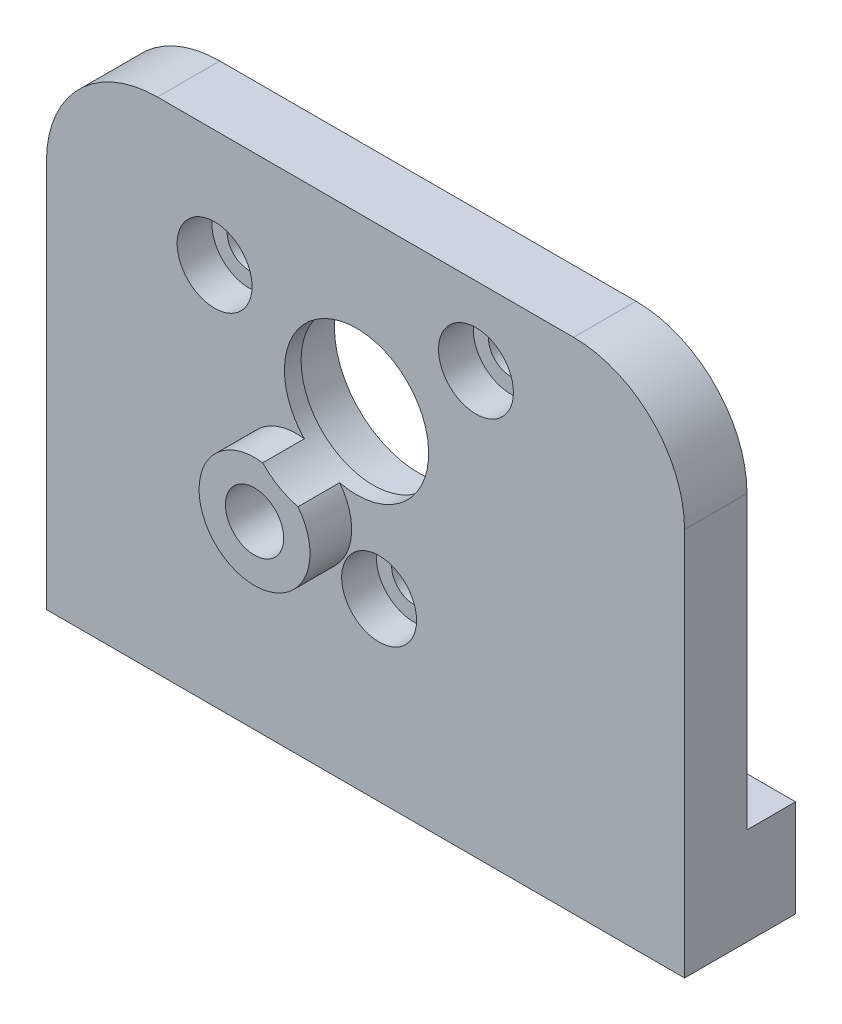
ISO-10303-21;
HEADER;
FILE_DESCRIPTION(('STEP AP214'),'2;1');
FILE_NAME('part.step','',(''),(''),'','','');
FILE_SCHEMA(('AUTOMOTIVE_DESIGN { 1 0 10303 214 1 1 1 1 }'));
ENDSEC;
DATA;
#1=APPLICATION_CONTEXT('core data for automotive mechanical design processes');
#2=APPLICATION_PROTOCOL_DEFINITION('international standard','automotive_design',2000,#1);
#3=PRODUCT_CONTEXT('',#1,'mechanical');
#4=PRODUCT('Part','Part','',(#3));
#5=PRODUCT_RELATED_PRODUCT_CATEGORY('part','',(#4));
#6=PRODUCT_DEFINITION_FORMATION('','',#4);
#7=PRODUCT_DEFINITION_CONTEXT('part definition',#1,'design');
#8=PRODUCT_DEFINITION('design','',#6,#7);
#9=PRODUCT_DEFINITION_SHAPE('','',#8);
#10=(LENGTH_UNIT() NAMED_UNIT(*) SI_UNIT(.MILLI.,.METRE.));
#11=(NAMED_UNIT(*) PLANE_ANGLE_UNIT() SI_UNIT($,.RADIAN.));
#12=(NAMED_UNIT(*) SI_UNIT($,.STERADIAN.) SOLID_ANGLE_UNIT());
#13=UNCERTAINTY_MEASURE_WITH_UNIT(LENGTH_MEASURE(1.E-05),#10,'distance_accuracy_value','');
#14=(GEOMETRIC_REPRESENTATION_CONTEXT(3) GLOBAL_UNCERTAINTY_ASSIGNED_CONTEXT((#13)) GLOBAL_UNIT_ASSIGNED_CONTEXT((#10,
#11,#12)) REPRESENTATION_CONTEXT('',''));
#15=CARTESIAN_POINT('',(0.,0.,0.));
#16=DIRECTION('',(0.,0.,1.));
#17=DIRECTION('',(1.,0.,0.));
#18=AXIS2_PLACEMENT_3D('',#15,#16,#17);
#19=CARTESIAN_POINT('',(0.,0.,0.));
#20=DIRECTION('',(0.,0.,1.));
#21=DIRECTION('',(1.,0.,0.));
#22=AXIS2_PLACEMENT_3D('',#19,#20,#21);
#23=PLANE('',#22);
#24=CARTESIAN_POINT('',(0.980122741,-5.337445584,0.));
#25=DIRECTION('',(0.,0.,1.));
#26=DIRECTION('',(1.,0.,0.));
#27=AXIS2_PLACEMENT_3D('',#24,#25,#26);
#28=CIRCLE('',#27,1.60000000000001);
#29=CARTESIAN_POINT('',(2.58012274100001,-5.337445584,0.));
#30=VERTEX_POINT('',#29);
#31=EDGE_CURVE('E311',#30,#30,#28,.T.);
#32=ORIENTED_EDGE('',*,*,#31,.T.);
#33=EDGE_LOOP('',(#32));
#34=FACE_BOUND('',#33,.T.);
#35=CARTESIAN_POINT('',(7.962908944,12.389389916,0.));
#36=DIRECTION('',(0.,0.,1.));
#37=DIRECTION('',(1.,0.,0.));
#38=AXIS2_PLACEMENT_3D('',#35,#36,#37);
#39=CIRCLE('',#38,1.60000000000001);
#40=CARTESIAN_POINT('',(9.56290894400001,12.389389916,0.));
#41=VERTEX_POINT('',#40);
#42=EDGE_CURVE('E306',#41,#41,#39,.T.);
#43=ORIENTED_EDGE('',*,*,#42,.T.);
#44=EDGE_LOOP('',(#43));
#45=FACE_BOUND('',#44,.T.);
#46=CARTESIAN_POINT('',(-10.88037403,9.573242407,0.));
#47=DIRECTION('',(0.,0.,1.));
#48=DIRECTION('',(1.,0.,0.));
#49=AXIS2_PLACEMENT_3D('',#46,#47,#48);
#50=CIRCLE('',#49,1.60000000000001);
#51=CARTESIAN_POINT('',(-9.28037402999999,9.573242407,0.));
#52=VERTEX_POINT('',#51);
#53=EDGE_CURVE('E301',#52,#52,#50,.T.);
#54=ORIENTED_EDGE('',*,*,#53,.T.);
#55=EDGE_LOOP('',(#54));
#56=FACE_BOUND('',#55,.T.);
#57=CARTESIAN_POINT('',(-0.645780782,5.541728913,0.));
#58=DIRECTION('',(0.,0.,-1.));
#59=DIRECTION('',(-1.,0.,0.));
#60=AXIS2_PLACEMENT_3D('',#57,#58,#59);
#61=CIRCLE('',#60,6.10000000000001);
#62=CARTESIAN_POINT('',(-6.74578078200001,5.541728913,0.));
#63=VERTEX_POINT('',#62);
#64=EDGE_CURVE('E304',#63,#63,#61,.T.);
#65=ORIENTED_EDGE('',*,*,#64,.F.);
#66=EDGE_LOOP('',(#65));
#67=FACE_BOUND('',#66,.T.);
#68=DIRECTION('',(0.,-1.,0.));
#69=VECTOR('',#68,1.);
#70=CARTESIAN_POINT('',(-23.,18.,0.));
#71=LINE('',#70,#69);
#72=CARTESIAN_POINT('',(-23.,10.,0.));
#73=VERTEX_POINT('',#72);
#74=CARTESIAN_POINT('',(-23.,-11.,0.));
#75=VERTEX_POINT('',#74);
#76=EDGE_CURVE('E223',#73,#75,#71,.T.);
#77=ORIENTED_EDGE('',*,*,#76,.F.);
#78=CARTESIAN_POINT('',(-15.,10.,0.));
#79=DIRECTION('',(0.,0.,1.));
#80=DIRECTION('',(1.,0.,0.));
#81=AXIS2_PLACEMENT_3D('',#78,#79,#80);
#82=CIRCLE('',#81,8.);
#83=CARTESIAN_POINT('',(-15.,18.,0.));
#84=VERTEX_POINT('',#83);
#85=EDGE_CURVE('E40',#73,#84,#82,.F.);
#86=ORIENTED_EDGE('',*,*,#85,.T.);
#87=DIRECTION('',(-1.,0.,0.));
#88=VECTOR('',#87,1.);
#89=CARTESIAN_POINT('',(23.,18.,0.));
#90=LINE('',#89,#88);
#91=CARTESIAN_POINT('',(15.,18.,0.));
#92=VERTEX_POINT('',#91);
#93=EDGE_CURVE('E253',#92,#84,#90,.T.);
#94=ORIENTED_EDGE('',*,*,#93,.F.);
#95=CARTESIAN_POINT('',(15.,10.,0.));
#96=DIRECTION('',(0.,0.,1.));
#97=DIRECTION('',(1.,0.,0.));
#98=AXIS2_PLACEMENT_3D('',#95,#96,#97);
#99=CIRCLE('',#98,8.);
#100=CARTESIAN_POINT('',(23.,10.,0.));
#101=VERTEX_POINT('',#100);
#102=EDGE_CURVE('E47',#92,#101,#99,.F.);
#103=ORIENTED_EDGE('',*,*,#102,.T.);
#104=DIRECTION('',(0.,1.,0.));
#105=VECTOR('',#104,1.);
#106=CARTESIAN_POINT('',(23.,-18.,0.));
#107=LINE('',#106,#105);
#108=CARTESIAN_POINT('',(23.,-11.,0.));
#109=VERTEX_POINT('',#108);
#110=EDGE_CURVE('E263',#109,#101,#107,.T.);
#111=ORIENTED_EDGE('',*,*,#110,.F.);
#112=DIRECTION('',(1.,0.,0.));
#113=VECTOR('',#112,1.);
#114=CARTESIAN_POINT('',(23.,-11.,0.));
#115=LINE('',#114,#113);
#116=CARTESIAN_POINT('',(18.,-11.,0.));
#117=VERTEX_POINT('',#116);
#118=EDGE_CURVE('E208',#117,#109,#115,.T.);
#119=ORIENTED_EDGE('',*,*,#118,.F.);
#120=CARTESIAN_POINT('',(18.,-14.,0.));
#121=DIRECTION('',(0.,0.,1.));
#122=DIRECTION('',(1.,0.,0.));
#123=AXIS2_PLACEMENT_3D('',#120,#121,#122);
#124=CIRCLE('',#123,3.);
#125=CARTESIAN_POINT('',(15.,-14.,0.));
#126=VERTEX_POINT('',#125);
#127=EDGE_CURVE('E239',#117,#126,#124,.T.);
#128=ORIENTED_EDGE('',*,*,#127,.T.);
#129=DIRECTION('',(0.,1.,0.));
#130=VECTOR('',#129,1.);
#131=CARTESIAN_POINT('',(15.,-11.,0.));
#132=LINE('',#131,#130);
#133=CARTESIAN_POINT('',(15.,-18.,0.));
#134=VERTEX_POINT('',#133);
#135=EDGE_CURVE('E212',#134,#126,#132,.T.);
#136=ORIENTED_EDGE('',*,*,#135,.F.);
#137=DIRECTION('',(1.,0.,0.));
#138=VECTOR('',#137,1.);
#139=CARTESIAN_POINT('',(-23.,-18.,0.));
#140=LINE('',#139,#138);
#141=CARTESIAN_POINT('',(-15.0000000055,-18.,0.));
#142=VERTEX_POINT('',#141);
#143=EDGE_CURVE('E291',#142,#134,#140,.T.);
#144=ORIENTED_EDGE('',*,*,#143,.F.);
#145=DIRECTION('',(0.,-1.,0.));
#146=VECTOR('',#145,1.);
#147=CARTESIAN_POINT('',(-15.0000000055,-18.,0.));
#148=LINE('',#147,#146);
#149=CARTESIAN_POINT('',(-15.0000000055,-14.,0.));
#150=VERTEX_POINT('',#149);
#151=EDGE_CURVE('E183',#150,#142,#148,.T.);
#152=ORIENTED_EDGE('',*,*,#151,.F.);
#153=CARTESIAN_POINT('',(-18.0000000055,-14.,0.));
#154=DIRECTION('',(0.,0.,1.));
#155=DIRECTION('',(1.,0.,0.));
#156=AXIS2_PLACEMENT_3D('',#153,#154,#155);
#157=CIRCLE('',#156,3.);
#158=CARTESIAN_POINT('',(-18.0000000055,-11.,0.));
#159=VERTEX_POINT('',#158);
#160=EDGE_CURVE('E237',#150,#159,#157,.T.);
#161=ORIENTED_EDGE('',*,*,#160,.T.);
#162=DIRECTION('',(1.,0.,0.));
#163=VECTOR('',#162,1.);
#164=CARTESIAN_POINT('',(-15.0000000055,-11.,0.));
#165=LINE('',#164,#163);
#166=EDGE_CURVE('E179',#75,#159,#165,.T.);
#167=ORIENTED_EDGE('',*,*,#166,.F.);
#168=EDGE_LOOP('',(#77,#86,#94,#103,#111,#119,#128,#136,#144,#152,#161,#167));
#169=FACE_BOUND('',#168,.T.);
#170=ADVANCED_FACE('F32',(#34,#45,#56,#67,#169),#23,.F.);
#171=CARTESIAN_POINT('',(-23.,18.,0.));
#172=DIRECTION('',(-1.,0.,0.));
#173=DIRECTION('',(0.,0.,1.));
#174=AXIS2_PLACEMENT_3D('',#171,#172,#173);
#175=PLANE('',#174);
#176=DIRECTION('',(0.,-1.,0.));
#177=VECTOR('',#176,1.);
#178=CARTESIAN_POINT('',(-23.,18.,4.5));
#179=LINE('',#178,#177);
#180=CARTESIAN_POINT('',(-23.,10.,4.5));
#181=VERTEX_POINT('',#180);
#182=CARTESIAN_POINT('',(-23.,-18.,4.5));
#183=VERTEX_POINT('',#182);
#184=EDGE_CURVE('E269',#181,#183,#179,.T.);
#185=ORIENTED_EDGE('',*,*,#184,.F.);
#186=DIRECTION('',(0.,0.,1.));
#187=VECTOR('',#186,1.);
#188=CARTESIAN_POINT('',(-23.,10.,0.));
#189=LINE('',#188,#187);
#190=EDGE_CURVE('E55',#181,#73,#189,.F.);
#191=ORIENTED_EDGE('',*,*,#190,.T.);
#192=ORIENTED_EDGE('',*,*,#76,.T.);
#193=DIRECTION('',(0.,0.,1.));
#194=VECTOR('',#193,1.);
#195=CARTESIAN_POINT('',(-23.,-11.,-3.5));
#196=LINE('',#195,#194);
#197=CARTESIAN_POINT('',(-23.,-11.,-3.5));
#198=VERTEX_POINT('',#197);
#199=EDGE_CURVE('E205',#198,#75,#196,.T.);
#200=ORIENTED_EDGE('',*,*,#199,.F.);
#201=DIRECTION('',(0.,1.,0.));
#202=VECTOR('',#201,1.);
#203=CARTESIAN_POINT('',(-23.,-11.,-3.5));
#204=LINE('',#203,#202);
#205=CARTESIAN_POINT('',(-23.,-18.,-3.5));
#206=VERTEX_POINT('',#205);
#207=EDGE_CURVE('E190',#206,#198,#204,.T.);
#208=ORIENTED_EDGE('',*,*,#207,.F.);
#209=DIRECTION('',(0.,0.,1.));
#210=VECTOR('',#209,1.);
#211=CARTESIAN_POINT('',(-23.,-18.,0.));
#212=LINE('',#211,#210);
#213=EDGE_CURVE('E262',#206,#183,#212,.T.);
#214=ORIENTED_EDGE('',*,*,#213,.T.);
#215=EDGE_LOOP('',(#185,#191,#192,#200,#208,#214));
#216=FACE_BOUND('',#215,.T.);
#217=ADVANCED_FACE('F272',(#216),#175,.T.);
#218=CARTESIAN_POINT('',(23.,18.,0.));
#219=DIRECTION('',(0.,1.,0.));
#220=DIRECTION('',(0.,0.,1.));
#221=AXIS2_PLACEMENT_3D('',#218,#219,#220);
#222=PLANE('',#221);
#223=ORIENTED_EDGE('',*,*,#93,.T.);
#224=DIRECTION('',(0.,0.,1.));
#225=VECTOR('',#224,1.);
#226=CARTESIAN_POINT('',(-15.,18.,0.));
#227=LINE('',#226,#225);
#228=CARTESIAN_POINT('',(-15.,18.,4.5));
#229=VERTEX_POINT('',#228);
#230=EDGE_CURVE('E243',#84,#229,#227,.T.);
#231=ORIENTED_EDGE('',*,*,#230,.T.);
#232=DIRECTION('',(-1.,0.,0.));
#233=VECTOR('',#232,1.);
#234=CARTESIAN_POINT('',(23.,18.,4.5));
#235=LINE('',#234,#233);
#236=CARTESIAN_POINT('',(15.,18.,4.5));
#237=VERTEX_POINT('',#236);
#238=EDGE_CURVE('E271',#237,#229,#235,.T.);
#239=ORIENTED_EDGE('',*,*,#238,.F.);
#240=DIRECTION('',(0.,0.,1.));
#241=VECTOR('',#240,1.);
#242=CARTESIAN_POINT('',(15.,18.,0.));
#243=LINE('',#242,#241);
#244=EDGE_CURVE('E241',#237,#92,#243,.F.);
#245=ORIENTED_EDGE('',*,*,#244,.T.);
#246=EDGE_LOOP('',(#223,#231,#239,#245));
#247=FACE_BOUND('',#246,.T.);
#248=ADVANCED_FACE('F258',(#247),#222,.T.);
#249=CARTESIAN_POINT('',(23.,-18.,0.));
#250=DIRECTION('',(1.,0.,0.));
#251=DIRECTION('',(0.,0.,-1.));
#252=AXIS2_PLACEMENT_3D('',#249,#250,#251);
#253=PLANE('',#252);
#254=ORIENTED_EDGE('',*,*,#110,.T.);
#255=DIRECTION('',(0.,0.,1.));
#256=VECTOR('',#255,1.);
#257=CARTESIAN_POINT('',(23.,10.,0.));
#258=LINE('',#257,#256);
#259=CARTESIAN_POINT('',(23.,10.,4.5));
#260=VERTEX_POINT('',#259);
#261=EDGE_CURVE('E11',#101,#260,#258,.T.);
#262=ORIENTED_EDGE('',*,*,#261,.T.);
#263=DIRECTION('',(0.,1.,0.));
#264=VECTOR('',#263,1.);
#265=CARTESIAN_POINT('',(23.,-18.,4.5));
#266=LINE('',#265,#264);
#267=CARTESIAN_POINT('',(23.,-18.,4.5));
#268=VERTEX_POINT('',#267);
#269=EDGE_CURVE('E278',#268,#260,#266,.T.);
#270=ORIENTED_EDGE('',*,*,#269,.F.);
#271=DIRECTION('',(0.,0.,1.));
#272=VECTOR('',#271,1.);
#273=CARTESIAN_POINT('',(23.,-18.,0.));
#274=LINE('',#273,#272);
#275=CARTESIAN_POINT('',(23.,-18.,-3.5));
#276=VERTEX_POINT('',#275);
#277=EDGE_CURVE('E287',#276,#268,#274,.T.);
#278=ORIENTED_EDGE('',*,*,#277,.F.);
#279=DIRECTION('',(0.,-1.,0.));
#280=VECTOR('',#279,1.);
#281=CARTESIAN_POINT('',(23.,-18.,-3.5));
#282=LINE('',#281,#280);
#283=CARTESIAN_POINT('',(23.,-11.,-3.5));
#284=VERTEX_POINT('',#283);
#285=EDGE_CURVE('E211',#284,#276,#282,.T.);
#286=ORIENTED_EDGE('',*,*,#285,.F.);
#287=DIRECTION('',(0.,0.,1.));
#288=VECTOR('',#287,1.);
#289=CARTESIAN_POINT('',(23.,-11.,-3.5));
#290=LINE('',#289,#288);
#291=EDGE_CURVE('E276',#284,#109,#290,.T.);
#292=ORIENTED_EDGE('',*,*,#291,.T.);
#293=EDGE_LOOP('',(#254,#262,#270,#278,#286,#292));
#294=FACE_BOUND('',#293,.T.);
#295=ADVANCED_FACE('F340',(#294),#253,.T.);
#296=CARTESIAN_POINT('',(-23.,-18.,0.));
#297=DIRECTION('',(0.,-1.,0.));
#298=DIRECTION('',(0.,0.,-1.));
#299=AXIS2_PLACEMENT_3D('',#296,#297,#298);
#300=PLANE('',#299);
#301=CARTESIAN_POINT('',(19.,-18.,0.5));
#302=DIRECTION('',(0.,-1.,0.));
#303=DIRECTION('',(0.,0.,-1.));
#304=AXIS2_PLACEMENT_3D('',#301,#302,#303);
#305=CIRCLE('',#304,1.24999999999999);
#306=CARTESIAN_POINT('',(19.,-18.,-0.749999999999991));
#307=VERTEX_POINT('',#306);
#308=EDGE_CURVE('E531',#307,#307,#305,.T.);
#309=ORIENTED_EDGE('',*,*,#308,.F.);
#310=EDGE_LOOP('',(#309));
#311=FACE_BOUND('',#310,.T.);
#312=CARTESIAN_POINT('',(-19.,-18.,0.5));
#313=DIRECTION('',(0.,-1.,0.));
#314=DIRECTION('',(0.,0.,-1.));
#315=AXIS2_PLACEMENT_3D('',#312,#313,#314);
#316=CIRCLE('',#315,1.24999999999999);
#317=CARTESIAN_POINT('',(-19.,-18.,-0.749999999999991));
#318=VERTEX_POINT('',#317);
#319=EDGE_CURVE('E537',#318,#318,#316,.T.);
#320=ORIENTED_EDGE('',*,*,#319,.F.);
#321=EDGE_LOOP('',(#320));
#322=FACE_BOUND('',#321,.T.);
#323=CARTESIAN_POINT('',(0.,-18.,2.25));
#324=DIRECTION('',(0.,-1.,0.));
#325=DIRECTION('',(0.,0.,-1.));
#326=AXIS2_PLACEMENT_3D('',#323,#324,#325);
#327=CIRCLE('',#326,0.84999999999999);
#328=CARTESIAN_POINT('',(0.,-18.,1.40000000000001));
#329=VERTEX_POINT('',#328);
#330=EDGE_CURVE('E186',#329,#329,#327,.T.);
#331=ORIENTED_EDGE('',*,*,#330,.F.);
#332=EDGE_LOOP('',(#331));
#333=FACE_BOUND('',#332,.T.);
#334=DIRECTION('',(1.,0.,0.));
#335=VECTOR('',#334,1.);
#336=CARTESIAN_POINT('',(-23.,-18.,4.5));
#337=LINE('',#336,#335);
#338=EDGE_CURVE('E275',#183,#268,#337,.T.);
#339=ORIENTED_EDGE('',*,*,#338,.F.);
#340=ORIENTED_EDGE('',*,*,#213,.F.);
#341=DIRECTION('',(-1.,0.,0.));
#342=VECTOR('',#341,1.);
#343=CARTESIAN_POINT('',(-23.,-18.,-3.5));
#344=LINE('',#343,#342);
#345=CARTESIAN_POINT('',(-15.0000000055,-18.,-3.5));
#346=VERTEX_POINT('',#345);
#347=EDGE_CURVE('E198',#346,#206,#344,.T.);
#348=ORIENTED_EDGE('',*,*,#347,.F.);
#349=DIRECTION('',(0.,0.,1.));
#350=VECTOR('',#349,1.);
#351=CARTESIAN_POINT('',(-15.0000000055,-18.,-3.5));
#352=LINE('',#351,#350);
#353=EDGE_CURVE('E200',#346,#142,#352,.T.);
#354=ORIENTED_EDGE('',*,*,#353,.T.);
#355=ORIENTED_EDGE('',*,*,#143,.T.);
#356=DIRECTION('',(0.,0.,1.));
#357=VECTOR('',#356,1.);
#358=CARTESIAN_POINT('',(15.,-18.,-3.5));
#359=LINE('',#358,#357);
#360=CARTESIAN_POINT('',(15.,-18.,-3.5));
#361=VERTEX_POINT('',#360);
#362=EDGE_CURVE('E220',#361,#134,#359,.T.);
#363=ORIENTED_EDGE('',*,*,#362,.F.);
#364=DIRECTION('',(-1.,0.,0.));
#365=VECTOR('',#364,1.);
#366=CARTESIAN_POINT('',(15.,-18.,-3.5));
#367=LINE('',#366,#365);
#368=EDGE_CURVE('E215',#276,#361,#367,.T.);
#369=ORIENTED_EDGE('',*,*,#368,.F.);
#370=ORIENTED_EDGE('',*,*,#277,.T.);
#371=EDGE_LOOP('',(#339,#340,#348,#354,#355,#363,#369,#370));
#372=FACE_BOUND('',#371,.T.);
#373=ADVANCED_FACE('F336',(#311,#322,#333,#372),#300,.T.);
#374=CARTESIAN_POINT('',(0.,0.,4.5));
#375=DIRECTION('',(0.,0.,1.));
#376=DIRECTION('',(1.,0.,0.));
#377=AXIS2_PLACEMENT_3D('',#374,#375,#376);
#378=PLANE('',#377);
#379=CARTESIAN_POINT('',(0.980122741,-5.337445584,4.5));
#380=DIRECTION('',(0.,0.,1.));
#381=DIRECTION('',(1.,0.,0.));
#382=AXIS2_PLACEMENT_3D('',#379,#380,#381);
#383=CIRCLE('',#382,2.7);
#384=CARTESIAN_POINT('',(3.680122741,-5.337445584,4.5));
#385=VERTEX_POINT('',#384);
#386=EDGE_CURVE('E499',#385,#385,#383,.T.);
#387=ORIENTED_EDGE('',*,*,#386,.F.);
#388=EDGE_LOOP('',(#387));
#389=FACE_BOUND('',#388,.T.);
#390=CARTESIAN_POINT('',(7.962908944,12.389389916,4.5));
#391=DIRECTION('',(0.,0.,1.));
#392=DIRECTION('',(1.,0.,0.));
#393=AXIS2_PLACEMENT_3D('',#390,#391,#392);
#394=CIRCLE('',#393,2.7);
#395=CARTESIAN_POINT('',(10.662908944,12.389389916,4.5));
#396=VERTEX_POINT('',#395);
#397=EDGE_CURVE('E314',#396,#396,#394,.T.);
#398=ORIENTED_EDGE('',*,*,#397,.F.);
#399=EDGE_LOOP('',(#398));
#400=FACE_BOUND('',#399,.T.);
#401=CARTESIAN_POINT('',(-10.88037403,9.573242407,4.5));
#402=DIRECTION('',(0.,0.,1.));
#403=DIRECTION('',(1.,0.,0.));
#404=AXIS2_PLACEMENT_3D('',#401,#402,#403);
#405=CIRCLE('',#404,2.7);
#406=CARTESIAN_POINT('',(-8.18037403,9.573242407,4.5));
#407=VERTEX_POINT('',#406);
#408=EDGE_CURVE('E309',#407,#407,#405,.T.);
#409=ORIENTED_EDGE('',*,*,#408,.F.);
#410=EDGE_LOOP('',(#409));
#411=FACE_BOUND('',#410,.T.);
#412=CARTESIAN_POINT('',(-0.645780782,5.541728913,4.5));
#413=DIRECTION('',(0.,0.,1.));
#414=DIRECTION('',(1.,0.,0.));
#415=AXIS2_PLACEMENT_3D('',#412,#413,#414);
#416=CIRCLE('',#415,5.20000000000001);
#417=CARTESIAN_POINT('',(-1.86733082093688,0.487244220929658,4.5));
#418=VERTEX_POINT('',#417);
#419=CARTESIAN_POINT('',(-4.41231790885004,1.95659320119489,4.5));
#420=VERTEX_POINT('',#419);
#421=EDGE_CURVE('E167',#418,#420,#416,.T.);
#422=ORIENTED_EDGE('',*,*,#421,.F.);
#423=CARTESIAN_POINT('',(-5.,-2.,4.5));
#424=DIRECTION('',(0.,0.,1.));
#425=DIRECTION('',(1.,0.,0.));
#426=AXIS2_PLACEMENT_3D('',#423,#424,#425);
#427=CIRCLE('',#426,4.);
#428=EDGE_CURVE('E175',#420,#418,#427,.T.);
#429=ORIENTED_EDGE('',*,*,#428,.F.);
#430=EDGE_LOOP('',(#422,#429));
#431=FACE_BOUND('',#430,.T.);
#432=ORIENTED_EDGE('',*,*,#238,.T.);
#433=CARTESIAN_POINT('',(-15.,10.,4.5));
#434=DIRECTION('',(0.,0.,1.));
#435=DIRECTION('',(1.,0.,0.));
#436=AXIS2_PLACEMENT_3D('',#433,#434,#435);
#437=CIRCLE('',#436,8.);
#438=EDGE_CURVE('E248',#229,#181,#437,.T.);
#439=ORIENTED_EDGE('',*,*,#438,.T.);
#440=ORIENTED_EDGE('',*,*,#184,.T.);
#441=ORIENTED_EDGE('',*,*,#338,.T.);
#442=ORIENTED_EDGE('',*,*,#269,.T.);
#443=CARTESIAN_POINT('',(15.,10.,4.5));
#444=DIRECTION('',(0.,0.,1.));
#445=DIRECTION('',(1.,0.,0.));
#446=AXIS2_PLACEMENT_3D('',#443,#444,#445);
#447=CIRCLE('',#446,8.);
#448=EDGE_CURVE('E246',#260,#237,#447,.T.);
#449=ORIENTED_EDGE('',*,*,#448,.T.);
#450=EDGE_LOOP('',(#432,#439,#440,#441,#442,#449));
#451=FACE_BOUND('',#450,.T.);
#452=ADVANCED_FACE('F267',(#389,#400,#411,#431,#451),#378,.T.);
#453=CARTESIAN_POINT('',(23.,-11.,-3.5));
#454=DIRECTION('',(0.,-1.,0.));
#455=DIRECTION('',(0.,0.,-1.));
#456=AXIS2_PLACEMENT_3D('',#453,#454,#455);
#457=PLANE('',#456);
#458=DIRECTION('',(1.,0.,0.));
#459=VECTOR('',#458,1.);
#460=CARTESIAN_POINT('',(23.,-11.,-3.5));
#461=LINE('',#460,#459);
#462=CARTESIAN_POINT('',(18.,-11.,-3.5));
#463=VERTEX_POINT('',#462);
#464=EDGE_CURVE('E209',#463,#284,#461,.T.);
#465=ORIENTED_EDGE('',*,*,#464,.F.);
#466=DIRECTION('',(0.,0.,1.));
#467=VECTOR('',#466,1.);
#468=CARTESIAN_POINT('',(18.,-11.,-3.5));
#469=LINE('',#468,#467);
#470=EDGE_CURVE('E230',#463,#117,#469,.T.);
#471=ORIENTED_EDGE('',*,*,#470,.T.);
#472=ORIENTED_EDGE('',*,*,#118,.T.);
#473=ORIENTED_EDGE('',*,*,#291,.F.);
#474=EDGE_LOOP('',(#465,#471,#472,#473));
#475=FACE_BOUND('',#474,.T.);
#476=ADVANCED_FACE('F359',(#475),#457,.F.);
#477=CARTESIAN_POINT('',(15.,-11.,-3.5));
#478=DIRECTION('',(1.,0.,0.));
#479=DIRECTION('',(0.,0.,-1.));
#480=AXIS2_PLACEMENT_3D('',#477,#478,#479);
#481=PLANE('',#480);
#482=ORIENTED_EDGE('',*,*,#135,.T.);
#483=DIRECTION('',(0.,0.,1.));
#484=VECTOR('',#483,1.);
#485=CARTESIAN_POINT('',(15.,-14.,-3.5));
#486=LINE('',#485,#484);
#487=CARTESIAN_POINT('',(15.,-14.,-3.5));
#488=VERTEX_POINT('',#487);
#489=EDGE_CURVE('E233',#126,#488,#486,.F.);
#490=ORIENTED_EDGE('',*,*,#489,.T.);
#491=DIRECTION('',(0.,1.,0.));
#492=VECTOR('',#491,1.);
#493=CARTESIAN_POINT('',(15.,-11.,-3.5));
#494=LINE('',#493,#492);
#495=EDGE_CURVE('E217',#361,#488,#494,.T.);
#496=ORIENTED_EDGE('',*,*,#495,.F.);
#497=ORIENTED_EDGE('',*,*,#362,.T.);
#498=EDGE_LOOP('',(#482,#490,#496,#497));
#499=FACE_BOUND('',#498,.T.);
#500=ADVANCED_FACE('F394',(#499),#481,.F.);
#501=CARTESIAN_POINT('',(0.,0.,-3.5));
#502=DIRECTION('',(0.,0.,1.));
#503=DIRECTION('',(1.,0.,0.));
#504=AXIS2_PLACEMENT_3D('',#501,#502,#503);
#505=PLANE('',#504);
#506=ORIENTED_EDGE('',*,*,#495,.T.);
#507=CARTESIAN_POINT('',(18.,-14.,-3.5));
#508=DIRECTION('',(0.,0.,1.));
#509=DIRECTION('',(1.,0.,0.));
#510=AXIS2_PLACEMENT_3D('',#507,#508,#509);
#511=CIRCLE('',#510,3.);
#512=EDGE_CURVE('E235',#488,#463,#511,.F.);
#513=ORIENTED_EDGE('',*,*,#512,.T.);
#514=ORIENTED_EDGE('',*,*,#464,.T.);
#515=ORIENTED_EDGE('',*,*,#285,.T.);
#516=ORIENTED_EDGE('',*,*,#368,.T.);
#517=EDGE_LOOP('',(#506,#513,#514,#515,#516));
#518=FACE_BOUND('',#517,.T.);
#519=ADVANCED_FACE('F383',(#518),#505,.F.);
#520=CARTESIAN_POINT('',(-15.0000000055,-11.,-3.5));
#521=DIRECTION('',(0.,-1.,0.));
#522=DIRECTION('',(0.,0.,-1.));
#523=AXIS2_PLACEMENT_3D('',#520,#521,#522);
#524=PLANE('',#523);
#525=ORIENTED_EDGE('',*,*,#166,.T.);
#526=DIRECTION('',(0.,0.,1.));
#527=VECTOR('',#526,1.);
#528=CARTESIAN_POINT('',(-18.0000000055,-11.,-3.5));
#529=LINE('',#528,#527);
#530=CARTESIAN_POINT('',(-18.0000000055,-11.,-3.5));
#531=VERTEX_POINT('',#530);
#532=EDGE_CURVE('E317',#159,#531,#529,.F.);
#533=ORIENTED_EDGE('',*,*,#532,.T.);
#534=DIRECTION('',(1.,0.,0.));
#535=VECTOR('',#534,1.);
#536=CARTESIAN_POINT('',(-15.0000000055,-11.,-3.5));
#537=LINE('',#536,#535);
#538=EDGE_CURVE('E193',#198,#531,#537,.T.);
#539=ORIENTED_EDGE('',*,*,#538,.F.);
#540=ORIENTED_EDGE('',*,*,#199,.T.);
#541=EDGE_LOOP('',(#525,#533,#539,#540));
#542=FACE_BOUND('',#541,.T.);
#543=ADVANCED_FACE('F333',(#542),#524,.F.);
#544=CARTESIAN_POINT('',(-15.0000000055,-18.,-3.5));
#545=DIRECTION('',(-1.,0.,0.));
#546=DIRECTION('',(0.,0.,1.));
#547=AXIS2_PLACEMENT_3D('',#544,#545,#546);
#548=PLANE('',#547);
#549=DIRECTION('',(0.,-1.,0.));
#550=VECTOR('',#549,1.);
#551=CARTESIAN_POINT('',(-15.0000000055,-18.,-3.5));
#552=LINE('',#551,#550);
#553=CARTESIAN_POINT('',(-15.0000000055,-14.,-3.5));
#554=VERTEX_POINT('',#553);
#555=EDGE_CURVE('E196',#554,#346,#552,.T.);
#556=ORIENTED_EDGE('',*,*,#555,.F.);
#557=DIRECTION('',(0.,0.,1.));
#558=VECTOR('',#557,1.);
#559=CARTESIAN_POINT('',(-15.0000000055,-14.,-3.5));
#560=LINE('',#559,#558);
#561=EDGE_CURVE('E176',#554,#150,#560,.T.);
#562=ORIENTED_EDGE('',*,*,#561,.T.);
#563=ORIENTED_EDGE('',*,*,#151,.T.);
#564=ORIENTED_EDGE('',*,*,#353,.F.);
#565=EDGE_LOOP('',(#556,#562,#563,#564));
#566=FACE_BOUND('',#565,.T.);
#567=ADVANCED_FACE('F328',(#566),#548,.F.);
#568=CARTESIAN_POINT('',(0.,0.,-3.5));
#569=DIRECTION('',(0.,0.,1.));
#570=DIRECTION('',(1.,0.,0.));
#571=AXIS2_PLACEMENT_3D('',#568,#569,#570);
#572=PLANE('',#571);
#573=ORIENTED_EDGE('',*,*,#538,.T.);
#574=CARTESIAN_POINT('',(-18.0000000055,-14.,-3.5));
#575=DIRECTION('',(0.,0.,1.));
#576=DIRECTION('',(1.,0.,0.));
#577=AXIS2_PLACEMENT_3D('',#574,#575,#576);
#578=CIRCLE('',#577,3.);
#579=EDGE_CURVE('E228',#531,#554,#578,.F.);
#580=ORIENTED_EDGE('',*,*,#579,.T.);
#581=ORIENTED_EDGE('',*,*,#555,.T.);
#582=ORIENTED_EDGE('',*,*,#347,.T.);
#583=ORIENTED_EDGE('',*,*,#207,.T.);
#584=EDGE_LOOP('',(#573,#580,#581,#582,#583));
#585=FACE_BOUND('',#584,.T.);
#586=ADVANCED_FACE('F323',(#585),#572,.F.);
#587=CARTESIAN_POINT('',(-5.,-2.,7.5));
#588=DIRECTION('',(0.,0.,-1.));
#589=DIRECTION('',(-1.,0.,0.));
#590=AXIS2_PLACEMENT_3D('',#587,#588,#589);
#591=CYLINDRICAL_SURFACE('',#590,4.);
#592=DIRECTION('',(0.,0.,-1.));
#593=VECTOR('',#592,1.);
#594=CARTESIAN_POINT('',(-1.86733082093688,0.487244220929658,5.4));
#595=LINE('',#594,#593);
#596=CARTESIAN_POINT('',(-1.86733082093688,0.487244220929658,7.5));
#597=VERTEX_POINT('',#596);
#598=EDGE_CURVE('E160',#597,#418,#595,.T.);
#599=ORIENTED_EDGE('',*,*,#598,.F.);
#600=CARTESIAN_POINT('',(-5.,-2.,7.5));
#601=DIRECTION('',(0.,0.,-1.));
#602=DIRECTION('',(-1.,0.,0.));
#603=AXIS2_PLACEMENT_3D('',#600,#601,#602);
#604=CIRCLE('',#603,4.);
#605=CARTESIAN_POINT('',(-4.41231790885004,1.95659320119489,7.5));
#606=VERTEX_POINT('',#605);
#607=EDGE_CURVE('E173',#597,#606,#604,.T.);
#608=ORIENTED_EDGE('',*,*,#607,.T.);
#609=DIRECTION('',(0.,0.,-1.));
#610=VECTOR('',#609,1.);
#611=CARTESIAN_POINT('',(-4.41231790885004,1.95659320119489,5.4));
#612=LINE('',#611,#610);
#613=EDGE_CURVE('E163',#420,#606,#612,.F.);
#614=ORIENTED_EDGE('',*,*,#613,.F.);
#615=ORIENTED_EDGE('',*,*,#428,.T.);
#616=EDGE_LOOP('',(#599,#608,#614,#615));
#617=FACE_BOUND('',#616,.T.);
#618=ADVANCED_FACE('F172',(#617),#591,.T.);
#619=CARTESIAN_POINT('',(-0.999999999999999,-2.,7.5));
#620=DIRECTION('',(0.,0.,1.));
#621=DIRECTION('',(1.,0.,0.));
#622=AXIS2_PLACEMENT_3D('',#619,#620,#621);
#623=PLANE('',#622);
#624=CARTESIAN_POINT('',(-5.,-2.,7.5));
#625=DIRECTION('',(0.,0.,1.));
#626=DIRECTION('',(1.,0.,0.));
#627=AXIS2_PLACEMENT_3D('',#624,#625,#626);
#628=CIRCLE('',#627,2.09999999999999);
#629=CARTESIAN_POINT('',(-2.90000000000001,-2.,7.5));
#630=VERTEX_POINT('',#629);
#631=EDGE_CURVE('E497',#630,#630,#628,.T.);
#632=ORIENTED_EDGE('',*,*,#631,.F.);
#633=EDGE_LOOP('',(#632));
#634=FACE_BOUND('',#633,.T.);
#635=CARTESIAN_POINT('',(-0.645780782,5.541728913,7.5));
#636=DIRECTION('',(0.,0.,-1.));
#637=DIRECTION('',(-1.,0.,0.));
#638=AXIS2_PLACEMENT_3D('',#635,#636,#637);
#639=CIRCLE('',#638,5.20000000000001);
#640=EDGE_CURVE('E156',#597,#606,#639,.T.);
#641=ORIENTED_EDGE('',*,*,#640,.T.);
#642=ORIENTED_EDGE('',*,*,#607,.F.);
#643=EDGE_LOOP('',(#641,#642));
#644=FACE_BOUND('',#643,.T.);
#645=ADVANCED_FACE('F178',(#634,#644),#623,.T.);
#646=CARTESIAN_POINT('',(0.,-11.,2.25));
#647=DIRECTION('',(0.,-1.,0.));
#648=DIRECTION('',(0.,0.,-1.));
#649=AXIS2_PLACEMENT_3D('',#646,#647,#648);
#650=CONICAL_SURFACE('',#649,0.849999999999988,1.02974425882656);
#651=CARTESIAN_POINT('',(0.,-10.489268474,2.25));
#652=VERTEX_POINT('',#651);
#653=VERTEX_LOOP('',#652);
#654=FACE_BOUND('',#653,.T.);
#655=CARTESIAN_POINT('',(0.,-11.,2.25));
#656=DIRECTION('',(0.,-1.,0.));
#657=DIRECTION('',(0.,0.,-1.));
#658=AXIS2_PLACEMENT_3D('',#655,#656,#657);
#659=CIRCLE('',#658,0.849999999999988);
#660=CARTESIAN_POINT('',(0.,-11.,1.40000000000001));
#661=VERTEX_POINT('',#660);
#662=EDGE_CURVE('E180',#661,#661,#659,.T.);
#663=ORIENTED_EDGE('',*,*,#662,.T.);
#664=EDGE_LOOP('',(#663));
#665=FACE_BOUND('',#664,.T.);
#666=ADVANCED_FACE('F412',(#654,#665),#650,.F.);
#667=CARTESIAN_POINT('',(0.,-18.,2.25));
#668=DIRECTION('',(0.,-1.,0.));
#669=DIRECTION('',(0.,0.,-1.));
#670=AXIS2_PLACEMENT_3D('',#667,#668,#669);
#671=CYLINDRICAL_SURFACE('',#670,0.849999999999989);
#672=ORIENTED_EDGE('',*,*,#662,.F.);
#673=EDGE_LOOP('',(#672));
#674=FACE_BOUND('',#673,.T.);
#675=ORIENTED_EDGE('',*,*,#330,.T.);
#676=EDGE_LOOP('',(#675));
#677=FACE_BOUND('',#676,.T.);
#678=ADVANCED_FACE('F416',(#674,#677),#671,.F.);
#679=CARTESIAN_POINT('',(-19.,-12.,0.5));
#680=DIRECTION('',(0.,-1.,0.));
#681=DIRECTION('',(0.,0.,-1.));
#682=AXIS2_PLACEMENT_3D('',#679,#680,#681);
#683=CONICAL_SURFACE('',#682,1.24999999999999,1.02974425854996);
#684=CARTESIAN_POINT('',(-19.,-11.248924226,0.5));
#685=VERTEX_POINT('',#684);
#686=VERTEX_LOOP('',#685);
#687=FACE_BOUND('',#686,.T.);
#688=CARTESIAN_POINT('',(-19.,-12.,0.5));
#689=DIRECTION('',(0.,-1.,0.));
#690=DIRECTION('',(0.,0.,-1.));
#691=AXIS2_PLACEMENT_3D('',#688,#689,#690);
#692=CIRCLE('',#691,1.24999999999999);
#693=CARTESIAN_POINT('',(-19.,-12.,-0.749999999999987));
#694=VERTEX_POINT('',#693);
#695=EDGE_CURVE('E540',#694,#694,#692,.T.);
#696=ORIENTED_EDGE('',*,*,#695,.T.);
#697=EDGE_LOOP('',(#696));
#698=FACE_BOUND('',#697,.T.);
#699=ADVANCED_FACE('F420',(#687,#698),#683,.F.);
#700=CARTESIAN_POINT('',(-19.,-18.,0.5));
#701=DIRECTION('',(0.,-1.,0.));
#702=DIRECTION('',(0.,0.,-1.));
#703=AXIS2_PLACEMENT_3D('',#700,#701,#702);
#704=CYLINDRICAL_SURFACE('',#703,1.24999999999999);
#705=ORIENTED_EDGE('',*,*,#695,.F.);
#706=EDGE_LOOP('',(#705));
#707=FACE_BOUND('',#706,.T.);
#708=ORIENTED_EDGE('',*,*,#319,.T.);
#709=EDGE_LOOP('',(#708));
#710=FACE_BOUND('',#709,.T.);
#711=ADVANCED_FACE('F424',(#707,#710),#704,.F.);
#712=CARTESIAN_POINT('',(19.,-12.,0.5));
#713=DIRECTION('',(0.,-1.,0.));
#714=DIRECTION('',(0.,0.,-1.));
#715=AXIS2_PLACEMENT_3D('',#712,#713,#714);
#716=CONICAL_SURFACE('',#715,1.24999999999999,1.02974425854996);
#717=CARTESIAN_POINT('',(19.,-11.248924226,0.5));
#718=VERTEX_POINT('',#717);
#719=VERTEX_LOOP('',#718);
#720=FACE_BOUND('',#719,.T.);
#721=CARTESIAN_POINT('',(19.,-12.,0.5));
#722=DIRECTION('',(0.,-1.,0.));
#723=DIRECTION('',(0.,0.,-1.));
#724=AXIS2_PLACEMENT_3D('',#721,#722,#723);
#725=CIRCLE('',#724,1.24999999999999);
#726=CARTESIAN_POINT('',(19.,-12.,-0.749999999999987));
#727=VERTEX_POINT('',#726);
#728=EDGE_CURVE('E534',#727,#727,#725,.T.);
#729=ORIENTED_EDGE('',*,*,#728,.T.);
#730=EDGE_LOOP('',(#729));
#731=FACE_BOUND('',#730,.T.);
#732=ADVANCED_FACE('F428',(#720,#731),#716,.F.);
#733=CARTESIAN_POINT('',(19.,-18.,0.5));
#734=DIRECTION('',(0.,-1.,0.));
#735=DIRECTION('',(0.,0.,-1.));
#736=AXIS2_PLACEMENT_3D('',#733,#734,#735);
#737=CYLINDRICAL_SURFACE('',#736,1.24999999999999);
#738=ORIENTED_EDGE('',*,*,#728,.F.);
#739=EDGE_LOOP('',(#738));
#740=FACE_BOUND('',#739,.T.);
#741=ORIENTED_EDGE('',*,*,#308,.T.);
#742=EDGE_LOOP('',(#741));
#743=FACE_BOUND('',#742,.T.);
#744=ADVANCED_FACE('F432',(#740,#743),#737,.F.);
#745=CARTESIAN_POINT('',(-0.645780782,5.541728913,0.));
#746=DIRECTION('',(0.,0.,-1.));
#747=DIRECTION('',(-1.,0.,0.));
#748=AXIS2_PLACEMENT_3D('',#745,#746,#747);
#749=CYLINDRICAL_SURFACE('',#748,5.20000000000001);
#750=ORIENTED_EDGE('',*,*,#598,.T.);
#751=ORIENTED_EDGE('',*,*,#421,.T.);
#752=ORIENTED_EDGE('',*,*,#613,.T.);
#753=ORIENTED_EDGE('',*,*,#640,.F.);
#754=EDGE_LOOP('',(#750,#751,#752,#753));
#755=FACE_BOUND('',#754,.T.);
#756=CARTESIAN_POINT('',(-0.645780782,5.541728913,3.3));
#757=DIRECTION('',(0.,0.,-1.));
#758=DIRECTION('',(-1.,0.,0.));
#759=AXIS2_PLACEMENT_3D('',#756,#757,#758);
#760=CIRCLE('',#759,5.20000000000001);
#761=CARTESIAN_POINT('',(-5.84578078200001,5.541728913,3.3));
#762=VERTEX_POINT('',#761);
#763=EDGE_CURVE('E168',#762,#762,#760,.T.);
#764=ORIENTED_EDGE('',*,*,#763,.T.);
#765=EDGE_LOOP('',(#764));
#766=FACE_BOUND('',#765,.T.);
#767=ADVANCED_FACE('F158',(#755,#766),#749,.F.);
#768=CARTESIAN_POINT('',(4.55421921800001,5.541728913,3.3));
#769=DIRECTION('',(0.,0.,1.));
#770=DIRECTION('',(1.,0.,0.));
#771=AXIS2_PLACEMENT_3D('',#768,#769,#770);
#772=PLANE('',#771);
#773=ORIENTED_EDGE('',*,*,#763,.F.);
#774=EDGE_LOOP('',(#773));
#775=FACE_BOUND('',#774,.T.);
#776=CARTESIAN_POINT('',(-0.645780782,5.541728913,3.3));
#777=DIRECTION('',(0.,0.,-1.));
#778=DIRECTION('',(-1.,0.,0.));
#779=AXIS2_PLACEMENT_3D('',#776,#777,#778);
#780=CIRCLE('',#779,6.10000000000001);
#781=CARTESIAN_POINT('',(-6.74578078200001,5.541728913,3.3));
#782=VERTEX_POINT('',#781);
#783=EDGE_CURVE('E525',#782,#782,#780,.T.);
#784=ORIENTED_EDGE('',*,*,#783,.T.);
#785=EDGE_LOOP('',(#784));
#786=FACE_BOUND('',#785,.T.);
#787=ADVANCED_FACE('F439',(#775,#786),#772,.F.);
#788=CARTESIAN_POINT('',(-0.645780782,5.541728913,0.));
#789=DIRECTION('',(0.,0.,-1.));
#790=DIRECTION('',(-1.,0.,0.));
#791=AXIS2_PLACEMENT_3D('',#788,#789,#790);
#792=CYLINDRICAL_SURFACE('',#791,6.10000000000001);
#793=ORIENTED_EDGE('',*,*,#783,.F.);
#794=EDGE_LOOP('',(#793));
#795=FACE_BOUND('',#794,.T.);
#796=ORIENTED_EDGE('',*,*,#64,.T.);
#797=EDGE_LOOP('',(#796));
#798=FACE_BOUND('',#797,.T.);
#799=ADVANCED_FACE('F442',(#795,#798),#792,.F.);
#800=CARTESIAN_POINT('',(-10.88037403,9.573242407,4.5));
#801=DIRECTION('',(0.,0.,1.));
#802=DIRECTION('',(1.,0.,0.));
#803=AXIS2_PLACEMENT_3D('',#800,#801,#802);
#804=CYLINDRICAL_SURFACE('',#803,1.60000000000001);
#805=CARTESIAN_POINT('',(-10.88037403,9.573242407,2.));
#806=DIRECTION('',(0.,0.,1.));
#807=DIRECTION('',(1.,0.,0.));
#808=AXIS2_PLACEMENT_3D('',#805,#806,#807);
#809=CIRCLE('',#808,1.60000000000001);
#810=CARTESIAN_POINT('',(-9.28037402999999,9.573242407,2.));
#811=VERTEX_POINT('',#810);
#812=EDGE_CURVE('E305',#811,#811,#809,.T.);
#813=ORIENTED_EDGE('',*,*,#812,.T.);
#814=EDGE_LOOP('',(#813));
#815=FACE_BOUND('',#814,.T.);
#816=ORIENTED_EDGE('',*,*,#53,.F.);
#817=EDGE_LOOP('',(#816));
#818=FACE_BOUND('',#817,.T.);
#819=ADVANCED_FACE('F446',(#815,#818),#804,.F.);
#820=CARTESIAN_POINT('',(-9.28037402999999,9.573242407,2.));
#821=DIRECTION('',(0.,0.,-1.));
#822=DIRECTION('',(-1.,0.,0.));
#823=AXIS2_PLACEMENT_3D('',#820,#821,#822);
#824=PLANE('',#823);
#825=ORIENTED_EDGE('',*,*,#812,.F.);
#826=EDGE_LOOP('',(#825));
#827=FACE_BOUND('',#826,.T.);
#828=CARTESIAN_POINT('',(-10.88037403,9.573242407,2.));
#829=DIRECTION('',(0.,0.,1.));
#830=DIRECTION('',(1.,0.,0.));
#831=AXIS2_PLACEMENT_3D('',#828,#829,#830);
#832=CIRCLE('',#831,2.7);
#833=CARTESIAN_POINT('',(-8.18037403,9.573242407,2.));
#834=VERTEX_POINT('',#833);
#835=EDGE_CURVE('E518',#834,#834,#832,.T.);
#836=ORIENTED_EDGE('',*,*,#835,.T.);
#837=EDGE_LOOP('',(#836));
#838=FACE_BOUND('',#837,.T.);
#839=ADVANCED_FACE('F450',(#827,#838),#824,.F.);
#840=CARTESIAN_POINT('',(-10.88037403,9.573242407,4.5));
#841=DIRECTION('',(0.,0.,1.));
#842=DIRECTION('',(1.,0.,0.));
#843=AXIS2_PLACEMENT_3D('',#840,#841,#842);
#844=CYLINDRICAL_SURFACE('',#843,2.7);
#845=ORIENTED_EDGE('',*,*,#835,.F.);
#846=EDGE_LOOP('',(#845));
#847=FACE_BOUND('',#846,.T.);
#848=ORIENTED_EDGE('',*,*,#408,.T.);
#849=EDGE_LOOP('',(#848));
#850=FACE_BOUND('',#849,.T.);
#851=ADVANCED_FACE('F454',(#847,#850),#844,.F.);
#852=CARTESIAN_POINT('',(7.962908944,12.389389916,4.5));
#853=DIRECTION('',(0.,0.,1.));
#854=DIRECTION('',(1.,0.,0.));
#855=AXIS2_PLACEMENT_3D('',#852,#853,#854);
#856=CYLINDRICAL_SURFACE('',#855,1.60000000000001);
#857=CARTESIAN_POINT('',(7.962908944,12.389389916,2.));
#858=DIRECTION('',(0.,0.,1.));
#859=DIRECTION('',(1.,0.,0.));
#860=AXIS2_PLACEMENT_3D('',#857,#858,#859);
#861=CIRCLE('',#860,1.60000000000001);
#862=CARTESIAN_POINT('',(9.56290894400001,12.389389916,2.));
#863=VERTEX_POINT('',#862);
#864=EDGE_CURVE('E310',#863,#863,#861,.T.);
#865=ORIENTED_EDGE('',*,*,#864,.T.);
#866=EDGE_LOOP('',(#865));
#867=FACE_BOUND('',#866,.T.);
#868=ORIENTED_EDGE('',*,*,#42,.F.);
#869=EDGE_LOOP('',(#868));
#870=FACE_BOUND('',#869,.T.);
#871=ADVANCED_FACE('F458',(#867,#870),#856,.F.);
#872=CARTESIAN_POINT('',(9.56290894400001,12.389389916,2.));
#873=DIRECTION('',(0.,0.,-1.));
#874=DIRECTION('',(-1.,0.,0.));
#875=AXIS2_PLACEMENT_3D('',#872,#873,#874);
#876=PLANE('',#875);
#877=ORIENTED_EDGE('',*,*,#864,.F.);
#878=EDGE_LOOP('',(#877));
#879=FACE_BOUND('',#878,.T.);
#880=CARTESIAN_POINT('',(7.962908944,12.389389916,2.));
#881=DIRECTION('',(0.,0.,1.));
#882=DIRECTION('',(1.,0.,0.));
#883=AXIS2_PLACEMENT_3D('',#880,#881,#882);
#884=CIRCLE('',#883,2.7);
#885=CARTESIAN_POINT('',(10.662908944,12.389389916,2.));
#886=VERTEX_POINT('',#885);
#887=EDGE_CURVE('E511',#886,#886,#884,.T.);
#888=ORIENTED_EDGE('',*,*,#887,.T.);
#889=EDGE_LOOP('',(#888));
#890=FACE_BOUND('',#889,.T.);
#891=ADVANCED_FACE('F462',(#879,#890),#876,.F.);
#892=CARTESIAN_POINT('',(7.962908944,12.389389916,4.5));
#893=DIRECTION('',(0.,0.,1.));
#894=DIRECTION('',(1.,0.,0.));
#895=AXIS2_PLACEMENT_3D('',#892,#893,#894);
#896=CYLINDRICAL_SURFACE('',#895,2.7);
#897=ORIENTED_EDGE('',*,*,#887,.F.);
#898=EDGE_LOOP('',(#897));
#899=FACE_BOUND('',#898,.T.);
#900=ORIENTED_EDGE('',*,*,#397,.T.);
#901=EDGE_LOOP('',(#900));
#902=FACE_BOUND('',#901,.T.);
#903=ADVANCED_FACE('F466',(#899,#902),#896,.F.);
#904=CARTESIAN_POINT('',(0.980122741,-5.337445584,4.5));
#905=DIRECTION('',(0.,0.,1.));
#906=DIRECTION('',(1.,0.,0.));
#907=AXIS2_PLACEMENT_3D('',#904,#905,#906);
#908=CYLINDRICAL_SURFACE('',#907,1.60000000000001);
#909=CARTESIAN_POINT('',(0.980122741,-5.337445584,2.));
#910=DIRECTION('',(0.,0.,1.));
#911=DIRECTION('',(1.,0.,0.));
#912=AXIS2_PLACEMENT_3D('',#909,#910,#911);
#913=CIRCLE('',#912,1.60000000000001);
#914=CARTESIAN_POINT('',(2.58012274100001,-5.337445584,2.));
#915=VERTEX_POINT('',#914);
#916=EDGE_CURVE('E315',#915,#915,#913,.T.);
#917=ORIENTED_EDGE('',*,*,#916,.T.);
#918=EDGE_LOOP('',(#917));
#919=FACE_BOUND('',#918,.T.);
#920=ORIENTED_EDGE('',*,*,#31,.F.);
#921=EDGE_LOOP('',(#920));
#922=FACE_BOUND('',#921,.T.);
#923=ADVANCED_FACE('F470',(#919,#922),#908,.F.);
#924=CARTESIAN_POINT('',(2.58012274100001,-5.337445584,2.));
#925=DIRECTION('',(0.,0.,-1.));
#926=DIRECTION('',(-1.,0.,0.));
#927=AXIS2_PLACEMENT_3D('',#924,#925,#926);
#928=PLANE('',#927);
#929=ORIENTED_EDGE('',*,*,#916,.F.);
#930=EDGE_LOOP('',(#929));
#931=FACE_BOUND('',#930,.T.);
#932=CARTESIAN_POINT('',(0.980122741,-5.337445584,2.));
#933=DIRECTION('',(0.,0.,1.));
#934=DIRECTION('',(1.,0.,0.));
#935=AXIS2_PLACEMENT_3D('',#932,#933,#934);
#936=CIRCLE('',#935,2.7);
#937=CARTESIAN_POINT('',(3.680122741,-5.337445584,2.));
#938=VERTEX_POINT('',#937);
#939=EDGE_CURVE('E504',#938,#938,#936,.T.);
#940=ORIENTED_EDGE('',*,*,#939,.T.);
#941=EDGE_LOOP('',(#940));
#942=FACE_BOUND('',#941,.T.);
#943=ADVANCED_FACE('F474',(#931,#942),#928,.F.);
#944=CARTESIAN_POINT('',(0.980122741,-5.337445584,4.5));
#945=DIRECTION('',(0.,0.,1.));
#946=DIRECTION('',(1.,0.,0.));
#947=AXIS2_PLACEMENT_3D('',#944,#945,#946);
#948=CYLINDRICAL_SURFACE('',#947,2.7);
#949=ORIENTED_EDGE('',*,*,#939,.F.);
#950=EDGE_LOOP('',(#949));
#951=FACE_BOUND('',#950,.T.);
#952=ORIENTED_EDGE('',*,*,#386,.T.);
#953=EDGE_LOOP('',(#952));
#954=FACE_BOUND('',#953,.T.);
#955=ADVANCED_FACE('F478',(#951,#954),#948,.F.);
#956=CARTESIAN_POINT('',(-5.,-2.,0.500000000000007));
#957=DIRECTION('',(0.,0.,-1.));
#958=DIRECTION('',(-1.,0.,0.));
#959=AXIS2_PLACEMENT_3D('',#956,#957,#958);
#960=PLANE('',#959);
#961=CARTESIAN_POINT('',(-5.,-2.,0.500000000000007));
#962=DIRECTION('',(0.,0.,1.));
#963=DIRECTION('',(1.,0.,0.));
#964=AXIS2_PLACEMENT_3D('',#961,#962,#963);
#965=CIRCLE('',#964,2.09999999999999);
#966=CARTESIAN_POINT('',(-2.90000000000001,-2.,0.500000000000007));
#967=VERTEX_POINT('',#966);
#968=EDGE_CURVE('E494',#967,#967,#965,.T.);
#969=ORIENTED_EDGE('',*,*,#968,.T.);
#970=EDGE_LOOP('',(#969));
#971=FACE_BOUND('',#970,.T.);
#972=ADVANCED_FACE('F482',(#971),#960,.F.);
#973=CARTESIAN_POINT('',(-5.,-2.,7.5));
#974=DIRECTION('',(0.,0.,1.));
#975=DIRECTION('',(1.,0.,0.));
#976=AXIS2_PLACEMENT_3D('',#973,#974,#975);
#977=CYLINDRICAL_SURFACE('',#976,2.09999999999999);
#978=ORIENTED_EDGE('',*,*,#968,.F.);
#979=EDGE_LOOP('',(#978));
#980=FACE_BOUND('',#979,.T.);
#981=ORIENTED_EDGE('',*,*,#631,.T.);
#982=EDGE_LOOP('',(#981));
#983=FACE_BOUND('',#982,.T.);
#984=ADVANCED_FACE('F373',(#980,#983),#977,.F.);
#985=CARTESIAN_POINT('',(-18.0000000055,-14.,-3.5));
#986=DIRECTION('',(0.,0.,1.));
#987=DIRECTION('',(1.,0.,0.));
#988=AXIS2_PLACEMENT_3D('',#985,#986,#987);
#989=CYLINDRICAL_SURFACE('',#988,3.);
#990=ORIENTED_EDGE('',*,*,#579,.F.);
#991=ORIENTED_EDGE('',*,*,#532,.F.);
#992=ORIENTED_EDGE('',*,*,#160,.F.);
#993=ORIENTED_EDGE('',*,*,#561,.F.);
#994=EDGE_LOOP('',(#990,#991,#992,#993));
#995=FACE_BOUND('',#994,.T.);
#996=ADVANCED_FACE('F331',(#995),#989,.T.);
#997=CARTESIAN_POINT('',(18.,-14.,-3.5));
#998=DIRECTION('',(0.,0.,1.));
#999=DIRECTION('',(1.,0.,0.));
#1000=AXIS2_PLACEMENT_3D('',#997,#998,#999);
#1001=CYLINDRICAL_SURFACE('',#1000,3.);
#1002=ORIENTED_EDGE('',*,*,#512,.F.);
#1003=ORIENTED_EDGE('',*,*,#489,.F.);
#1004=ORIENTED_EDGE('',*,*,#127,.F.);
#1005=ORIENTED_EDGE('',*,*,#470,.F.);
#1006=EDGE_LOOP('',(#1002,#1003,#1004,#1005));
#1007=FACE_BOUND('',#1006,.T.);
#1008=ADVANCED_FACE('F348',(#1007),#1001,.T.);
#1009=CARTESIAN_POINT('',(-15.,10.,0.));
#1010=DIRECTION('',(0.,0.,1.));
#1011=DIRECTION('',(1.,0.,0.));
#1012=AXIS2_PLACEMENT_3D('',#1009,#1010,#1011);
#1013=CYLINDRICAL_SURFACE('',#1012,8.);
#1014=ORIENTED_EDGE('',*,*,#85,.F.);
#1015=ORIENTED_EDGE('',*,*,#190,.F.);
#1016=ORIENTED_EDGE('',*,*,#438,.F.);
#1017=ORIENTED_EDGE('',*,*,#230,.F.);
#1018=EDGE_LOOP('',(#1014,#1015,#1016,#1017));
#1019=FACE_BOUND('',#1018,.T.);
#1020=ADVANCED_FACE('F265',(#1019),#1013,.T.);
#1021=CARTESIAN_POINT('',(15.,10.,0.));
#1022=DIRECTION('',(0.,0.,1.));
#1023=DIRECTION('',(1.,0.,0.));
#1024=AXIS2_PLACEMENT_3D('',#1021,#1022,#1023);
#1025=CYLINDRICAL_SURFACE('',#1024,8.);
#1026=ORIENTED_EDGE('',*,*,#102,.F.);
#1027=ORIENTED_EDGE('',*,*,#244,.F.);
#1028=ORIENTED_EDGE('',*,*,#448,.F.);
#1029=ORIENTED_EDGE('',*,*,#261,.F.);
#1030=EDGE_LOOP('',(#1026,#1027,#1028,#1029));
#1031=FACE_BOUND('',#1030,.T.);
#1032=ADVANCED_FACE('F34',(#1031),#1025,.T.);
#1033=CLOSED_SHELL('',(#170,#217,#248,#295,#373,#452,#476,#500,#519,#543,#567,#586,#618,#645,
#666,#678,#699,#711,#732,#744,#767,#787,#799,#819,#839,#851,#871,#891,#903,#923,#943,#955,#972,
#984,#996,#1008,#1020,#1032));
#1034=MANIFOLD_SOLID_BREP('B2',#1033);
#1035=ADVANCED_BREP_SHAPE_REPRESENTATION('',(#18,#1034),#14);
#1036=SHAPE_DEFINITION_REPRESENTATION(#9,#1035);
ENDSEC;
END-ISO-10303-21;
